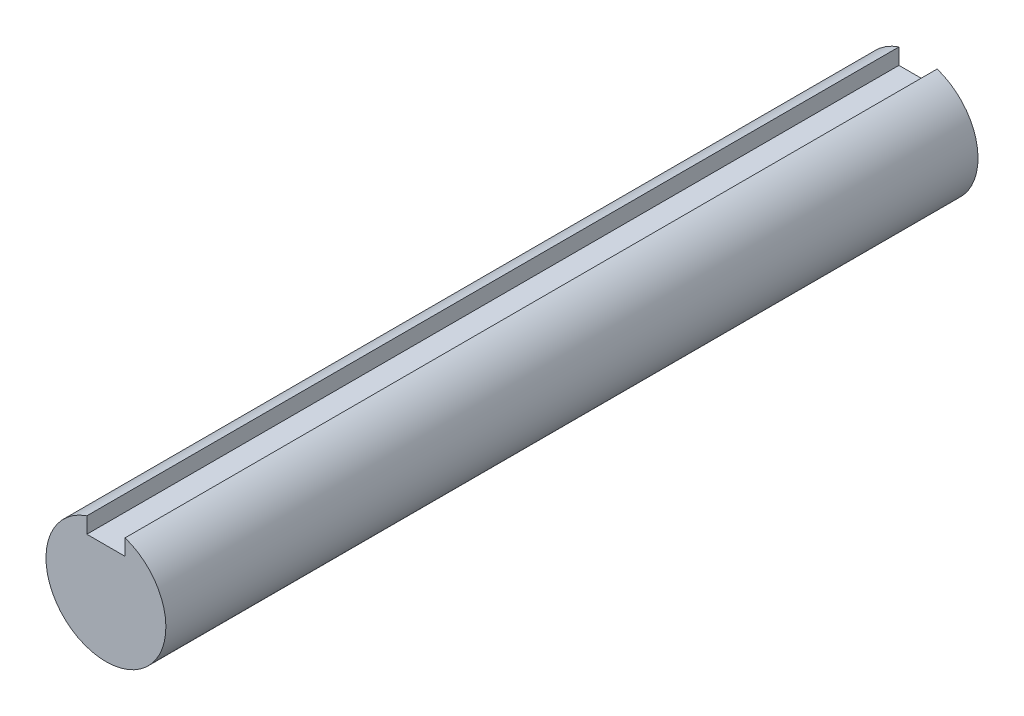
ISO-10303-21;
HEADER;
FILE_DESCRIPTION(('STEP AP214'),'2;1');
FILE_NAME('part.step','',(''),(''),'','','');
FILE_SCHEMA(('AUTOMOTIVE_DESIGN { 1 0 10303 214 1 1 1 1 }'));
ENDSEC;
DATA;
#1=APPLICATION_CONTEXT('core data for automotive mechanical design processes');
#2=APPLICATION_PROTOCOL_DEFINITION('international standard','automotive_design',2000,#1);
#3=PRODUCT_CONTEXT('',#1,'mechanical');
#4=PRODUCT('Part','Part','',(#3));
#5=PRODUCT_RELATED_PRODUCT_CATEGORY('part','',(#4));
#6=PRODUCT_DEFINITION_FORMATION('','',#4);
#7=PRODUCT_DEFINITION_CONTEXT('part definition',#1,'design');
#8=PRODUCT_DEFINITION('design','',#6,#7);
#9=PRODUCT_DEFINITION_SHAPE('','',#8);
#10=(LENGTH_UNIT() NAMED_UNIT(*) SI_UNIT(.MILLI.,.METRE.));
#11=(NAMED_UNIT(*) PLANE_ANGLE_UNIT() SI_UNIT($,.RADIAN.));
#12=(NAMED_UNIT(*) SI_UNIT($,.STERADIAN.) SOLID_ANGLE_UNIT());
#13=UNCERTAINTY_MEASURE_WITH_UNIT(LENGTH_MEASURE(1.E-05),#10,'distance_accuracy_value','');
#14=(GEOMETRIC_REPRESENTATION_CONTEXT(3) GLOBAL_UNCERTAINTY_ASSIGNED_CONTEXT((#13)) GLOBAL_UNIT_ASSIGNED_CONTEXT((#10,
#11,#12)) REPRESENTATION_CONTEXT('',''));
#15=CARTESIAN_POINT('',(0.,0.,0.));
#16=DIRECTION('',(0.,0.,1.));
#17=DIRECTION('',(1.,0.,0.));
#18=AXIS2_PLACEMENT_3D('',#15,#16,#17);
#19=CARTESIAN_POINT('',(0.,0.,101.6));
#20=DIRECTION('',(0.,0.,-1.));
#21=DIRECTION('',(-1.,0.,0.));
#22=AXIS2_PLACEMENT_3D('',#19,#20,#21);
#23=CYLINDRICAL_SURFACE('',#22,7.5);
#24=CARTESIAN_POINT('',(0.,0.,101.6));
#25=DIRECTION('',(0.,0.,1.));
#26=DIRECTION('',(1.,0.,0.));
#27=AXIS2_PLACEMENT_3D('',#24,#25,#26);
#28=CIRCLE('',#27,7.5);
#29=CARTESIAN_POINT('',(-2.39,7.1090013363341,101.6));
#30=VERTEX_POINT('',#29);
#31=CARTESIAN_POINT('',(2.39,7.1090013363341,101.6));
#32=VERTEX_POINT('',#31);
#33=EDGE_CURVE('E43',#30,#32,#28,.T.);
#34=ORIENTED_EDGE('',*,*,#33,.F.);
#35=DIRECTION('',(0.,0.,-1.));
#36=VECTOR('',#35,1.);
#37=CARTESIAN_POINT('',(-2.39,7.1090013363341,101.6));
#38=LINE('',#37,#36);
#39=CARTESIAN_POINT('',(-2.39,7.1090013363341,0.));
#40=VERTEX_POINT('',#39);
#41=EDGE_CURVE('E94',#30,#40,#38,.T.);
#42=ORIENTED_EDGE('',*,*,#41,.T.);
#43=CARTESIAN_POINT('',(0.,0.,0.));
#44=DIRECTION('',(0.,0.,1.));
#45=DIRECTION('',(1.,0.,0.));
#46=AXIS2_PLACEMENT_3D('',#43,#44,#45);
#47=CIRCLE('',#46,7.5);
#48=CARTESIAN_POINT('',(2.39,7.1090013363341,0.));
#49=VERTEX_POINT('',#48);
#50=EDGE_CURVE('E91',#40,#49,#47,.T.);
#51=ORIENTED_EDGE('',*,*,#50,.T.);
#52=DIRECTION('',(0.,0.,-1.));
#53=VECTOR('',#52,1.);
#54=CARTESIAN_POINT('',(2.39,7.1090013363341,101.6));
#55=LINE('',#54,#53);
#56=EDGE_CURVE('E97',#49,#32,#55,.F.);
#57=ORIENTED_EDGE('',*,*,#56,.T.);
#58=EDGE_LOOP('',(#34,#42,#51,#57));
#59=FACE_BOUND('',#58,.T.);
#60=ADVANCED_FACE('F36',(#59),#23,.T.);
#61=CARTESIAN_POINT('',(0.,0.,101.6));
#62=DIRECTION('',(0.,0.,1.));
#63=DIRECTION('',(1.,0.,0.));
#64=AXIS2_PLACEMENT_3D('',#61,#62,#63);
#65=PLANE('',#64);
#66=DIRECTION('',(0.,-1.,0.));
#67=VECTOR('',#66,1.);
#68=CARTESIAN_POINT('',(-2.39,7.5,101.6));
#69=LINE('',#68,#67);
#70=CARTESIAN_POINT('',(-2.39,5.11,101.6));
#71=VERTEX_POINT('',#70);
#72=EDGE_CURVE('E76',#30,#71,#69,.T.);
#73=ORIENTED_EDGE('',*,*,#72,.F.);
#74=ORIENTED_EDGE('',*,*,#33,.T.);
#75=DIRECTION('',(0.,1.,0.));
#76=VECTOR('',#75,1.);
#77=CARTESIAN_POINT('',(2.39,7.5,101.6));
#78=LINE('',#77,#76);
#79=CARTESIAN_POINT('',(2.39,5.11,101.6));
#80=VERTEX_POINT('',#79);
#81=EDGE_CURVE('E86',#80,#32,#78,.T.);
#82=ORIENTED_EDGE('',*,*,#81,.F.);
#83=DIRECTION('',(1.,0.,0.));
#84=VECTOR('',#83,1.);
#85=CARTESIAN_POINT('',(-2.39,5.11,101.6));
#86=LINE('',#85,#84);
#87=EDGE_CURVE('E103',#71,#80,#86,.T.);
#88=ORIENTED_EDGE('',*,*,#87,.F.);
#89=EDGE_LOOP('',(#73,#74,#82,#88));
#90=FACE_BOUND('',#89,.T.);
#91=ADVANCED_FACE('F108',(#90),#65,.T.);
#92=CARTESIAN_POINT('',(0.,0.,0.));
#93=DIRECTION('',(0.,0.,1.));
#94=DIRECTION('',(1.,0.,0.));
#95=AXIS2_PLACEMENT_3D('',#92,#93,#94);
#96=PLANE('',#95);
#97=ORIENTED_EDGE('',*,*,#50,.F.);
#98=DIRECTION('',(0.,-1.,0.));
#99=VECTOR('',#98,1.);
#100=CARTESIAN_POINT('',(-2.39,0.,0.));
#101=LINE('',#100,#99);
#102=CARTESIAN_POINT('',(-2.39,5.11,0.));
#103=VERTEX_POINT('',#102);
#104=EDGE_CURVE('E11',#40,#103,#101,.T.);
#105=ORIENTED_EDGE('',*,*,#104,.T.);
#106=DIRECTION('',(1.,0.,0.));
#107=VECTOR('',#106,1.);
#108=CARTESIAN_POINT('',(-2.39,5.11,0.));
#109=LINE('',#108,#107);
#110=CARTESIAN_POINT('',(2.39,5.11,0.));
#111=VERTEX_POINT('',#110);
#112=EDGE_CURVE('E83',#103,#111,#109,.T.);
#113=ORIENTED_EDGE('',*,*,#112,.T.);
#114=DIRECTION('',(0.,1.,0.));
#115=VECTOR('',#114,1.);
#116=CARTESIAN_POINT('',(2.39,7.5,0.));
#117=LINE('',#116,#115);
#118=EDGE_CURVE('E50',#111,#49,#117,.T.);
#119=ORIENTED_EDGE('',*,*,#118,.T.);
#120=EDGE_LOOP('',(#97,#105,#113,#119));
#121=FACE_BOUND('',#120,.T.);
#122=ADVANCED_FACE('F89',(#121),#96,.F.);
#123=CARTESIAN_POINT('',(-2.39,7.5,0.));
#124=DIRECTION('',(-1.,0.,0.));
#125=DIRECTION('',(0.,-1.,0.));
#126=AXIS2_PLACEMENT_3D('',#123,#124,#125);
#127=PLANE('',#126);
#128=ORIENTED_EDGE('',*,*,#72,.T.);
#129=DIRECTION('',(0.,0.,1.));
#130=VECTOR('',#129,1.);
#131=CARTESIAN_POINT('',(-2.39,5.11,0.));
#132=LINE('',#131,#130);
#133=EDGE_CURVE('E72',#103,#71,#132,.T.);
#134=ORIENTED_EDGE('',*,*,#133,.F.);
#135=ORIENTED_EDGE('',*,*,#104,.F.);
#136=ORIENTED_EDGE('',*,*,#41,.F.);
#137=EDGE_LOOP('',(#128,#134,#135,#136));
#138=FACE_BOUND('',#137,.T.);
#139=ADVANCED_FACE('F74',(#138),#127,.F.);
#140=CARTESIAN_POINT('',(2.39,7.5,0.));
#141=DIRECTION('',(1.,0.,0.));
#142=DIRECTION('',(0.,1.,0.));
#143=AXIS2_PLACEMENT_3D('',#140,#141,#142);
#144=PLANE('',#143);
#145=ORIENTED_EDGE('',*,*,#118,.F.);
#146=DIRECTION('',(0.,0.,1.));
#147=VECTOR('',#146,1.);
#148=CARTESIAN_POINT('',(2.39,5.11,0.));
#149=LINE('',#148,#147);
#150=EDGE_CURVE('E80',#111,#80,#149,.T.);
#151=ORIENTED_EDGE('',*,*,#150,.T.);
#152=ORIENTED_EDGE('',*,*,#81,.T.);
#153=ORIENTED_EDGE('',*,*,#56,.F.);
#154=EDGE_LOOP('',(#145,#151,#152,#153));
#155=FACE_BOUND('',#154,.T.);
#156=ADVANCED_FACE('F110',(#155),#144,.F.);
#157=CARTESIAN_POINT('',(-2.39,5.11,0.));
#158=DIRECTION('',(0.,-1.,0.));
#159=DIRECTION('',(0.,0.,-1.));
#160=AXIS2_PLACEMENT_3D('',#157,#158,#159);
#161=PLANE('',#160);
#162=ORIENTED_EDGE('',*,*,#87,.T.);
#163=ORIENTED_EDGE('',*,*,#150,.F.);
#164=ORIENTED_EDGE('',*,*,#112,.F.);
#165=ORIENTED_EDGE('',*,*,#133,.T.);
#166=EDGE_LOOP('',(#162,#163,#164,#165));
#167=FACE_BOUND('',#166,.T.);
#168=ADVANCED_FACE('F84',(#167),#161,.F.);
#169=CLOSED_SHELL('',(#60,#91,#122,#139,#156,#168));
#170=MANIFOLD_SOLID_BREP('B2',#169);
#171=ADVANCED_BREP_SHAPE_REPRESENTATION('',(#18,#170),#14);
#172=SHAPE_DEFINITION_REPRESENTATION(#9,#171);
ENDSEC;
END-ISO-10303-21;
